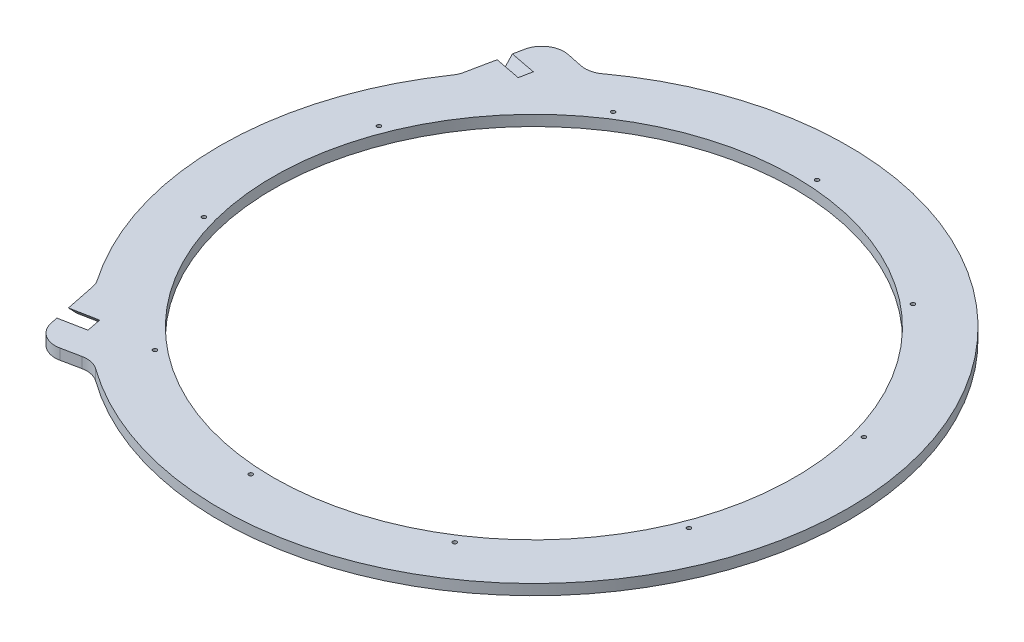
ISO-10303-21;
HEADER;
FILE_DESCRIPTION(('STEP AP214'),'2;1');
FILE_NAME('part.step','',(''),(''),'','','');
FILE_SCHEMA(('AUTOMOTIVE_DESIGN { 1 0 10303 214 1 1 1 1 }'));
ENDSEC;
DATA;
#1=APPLICATION_CONTEXT('core data for automotive mechanical design processes');
#2=APPLICATION_PROTOCOL_DEFINITION('international standard','automotive_design',2000,#1);
#3=PRODUCT_CONTEXT('',#1,'mechanical');
#4=PRODUCT('Part','Part','',(#3));
#5=PRODUCT_RELATED_PRODUCT_CATEGORY('part','',(#4));
#6=PRODUCT_DEFINITION_FORMATION('','',#4);
#7=PRODUCT_DEFINITION_CONTEXT('part definition',#1,'design');
#8=PRODUCT_DEFINITION('design','',#6,#7);
#9=PRODUCT_DEFINITION_SHAPE('','',#8);
#10=(LENGTH_UNIT() NAMED_UNIT(*) SI_UNIT(.MILLI.,.METRE.));
#11=(NAMED_UNIT(*) PLANE_ANGLE_UNIT() SI_UNIT($,.RADIAN.));
#12=(NAMED_UNIT(*) SI_UNIT($,.STERADIAN.) SOLID_ANGLE_UNIT());
#13=UNCERTAINTY_MEASURE_WITH_UNIT(LENGTH_MEASURE(1.E-05),#10,'distance_accuracy_value','');
#14=(GEOMETRIC_REPRESENTATION_CONTEXT(3) GLOBAL_UNCERTAINTY_ASSIGNED_CONTEXT((#13)) GLOBAL_UNIT_ASSIGNED_CONTEXT((#10,
#11,#12)) REPRESENTATION_CONTEXT('',''));
#15=CARTESIAN_POINT('',(0.,0.,0.));
#16=DIRECTION('',(0.,0.,1.));
#17=DIRECTION('',(1.,0.,0.));
#18=AXIS2_PLACEMENT_3D('',#15,#16,#17);
#19=CARTESIAN_POINT('',(-281.950699467775,0.,-245.84051269837));
#20=DIRECTION('',(0.979540105481507,0.,0.201249054043189));
#21=DIRECTION('',(0.201249054043189,0.,-0.979540105481507));
#22=AXIS2_PLACEMENT_3D('',#19,#20,#21);
#23=PLANE('',#22);
#24=DIRECTION('',(-0.114648249727768,-0.821864221756313,0.558027759014951));
#25=VECTOR('',#24,1.);
#26=CARTESIAN_POINT('',(-295.731190970236,-80.1248043204438,-178.766686368682));
#27=LINE('',#26,#25);
#28=CARTESIAN_POINT('',(-282.879983566072,12.,-241.317405506656));
#29=VERTEX_POINT('',#28);
#30=CARTESIAN_POINT('',(-284.553957149924,0.,-233.169669018176));
#31=VERTEX_POINT('',#30);
#32=EDGE_CURVE('E183',#29,#31,#27,.T.);
#33=ORIENTED_EDGE('',*,*,#32,.T.);
#34=DIRECTION('',(0.201249054043189,0.,-0.979540105481507));
#35=VECTOR('',#34,1.);
#36=CARTESIAN_POINT('',(-281.950699467775,0.,-245.84051269837));
#37=LINE('',#36,#35);
#38=CARTESIAN_POINT('',(-289.47071954455,0.,-209.238297128964));
#39=VERTEX_POINT('',#38);
#40=EDGE_CURVE('E212',#39,#31,#37,.T.);
#41=ORIENTED_EDGE('',*,*,#40,.F.);
#42=DIRECTION('',(0.,-1.,0.));
#43=VECTOR('',#42,1.);
#44=CARTESIAN_POINT('',(-289.47071954455,10.,-209.238297128964));
#45=LINE('',#44,#43);
#46=CARTESIAN_POINT('',(-289.47071954455,12.,-209.238297128964));
#47=VERTEX_POINT('',#46);
#48=EDGE_CURVE('E236',#39,#47,#45,.F.);
#49=ORIENTED_EDGE('',*,*,#48,.T.);
#50=DIRECTION('',(-0.201249054043192,0.,0.979540105481506));
#51=VECTOR('',#50,1.);
#52=CARTESIAN_POINT('',(-281.950699467774,12.,-245.840512698371));
#53=LINE('',#52,#51);
#54=EDGE_CURVE('E276',#29,#47,#53,.T.);
#55=ORIENTED_EDGE('',*,*,#54,.F.);
#56=EDGE_LOOP('',(#33,#41,#49,#55));
#57=FACE_BOUND('',#56,.T.);
#58=ADVANCED_FACE('F37',(#57),#23,.F.);
#59=CARTESIAN_POINT('',(-279.584698805436,0.,257.356554596679));
#60=DIRECTION('',(-0.979540105481507,0.,0.201249054043189));
#61=DIRECTION('',(0.201249054043189,0.,0.979540105481507));
#62=AXIS2_PLACEMENT_3D('',#59,#60,#61);
#63=PLANE('',#62);
#64=DIRECTION('',(0.201249054043189,0.,0.979540105481507));
#65=VECTOR('',#64,1.);
#66=CARTESIAN_POINT('',(-279.584698805436,0.,257.356554596679));
#67=LINE('',#66,#65);
#68=CARTESIAN_POINT('',(-289.47071954455,0.,209.238297128964));
#69=VERTEX_POINT('',#68);
#70=CARTESIAN_POINT('',(-284.553957149926,0.,233.169669018168));
#71=VERTEX_POINT('',#70);
#72=EDGE_CURVE('E246',#69,#71,#67,.T.);
#73=ORIENTED_EDGE('',*,*,#72,.T.);
#74=DIRECTION('',(0.140727943189144,0.714855141364583,0.684965526775162));
#75=VECTOR('',#74,1.);
#76=CARTESIAN_POINT('',(-285.869652164469,-6.68333043388236,226.765782851079));
#77=LINE('',#76,#75);
#78=CARTESIAN_POINT('',(-282.191610961793,12.,244.667923483557));
#79=VERTEX_POINT('',#78);
#80=EDGE_CURVE('E303',#71,#79,#77,.T.);
#81=ORIENTED_EDGE('',*,*,#80,.T.);
#82=DIRECTION('',(0.201249054043189,0.,0.979540105481507));
#83=VECTOR('',#82,1.);
#84=CARTESIAN_POINT('',(-289.47071954455,12.,209.238297128964));
#85=LINE('',#84,#83);
#86=CARTESIAN_POINT('',(-289.47071954455,12.,209.238297128964));
#87=VERTEX_POINT('',#86);
#88=EDGE_CURVE('E261',#87,#79,#85,.T.);
#89=ORIENTED_EDGE('',*,*,#88,.F.);
#90=DIRECTION('',(0.,1.,0.));
#91=VECTOR('',#90,1.);
#92=CARTESIAN_POINT('',(-289.47071954455,0.,209.238297128964));
#93=LINE('',#92,#91);
#94=EDGE_CURVE('E224',#87,#69,#93,.F.);
#95=ORIENTED_EDGE('',*,*,#94,.T.);
#96=EDGE_LOOP('',(#73,#81,#89,#95));
#97=FACE_BOUND('',#96,.T.);
#98=ADVANCED_FACE('F418',(#97),#63,.T.);
#99=CARTESIAN_POINT('',(0.,0.,0.));
#100=DIRECTION('',(0.,1.,0.));
#101=DIRECTION('',(0.,0.,1.));
#102=AXIS2_PLACEMENT_3D('',#99,#100,#101);
#103=PLANE('',#102);
#104=CARTESIAN_POINT('',(15.9624666541084,0.,-304.58200810016));
#105=DIRECTION('',(0.,1.,0.));
#106=DIRECTION('',(0.,0.,1.));
#107=AXIS2_PLACEMENT_3D('',#104,#105,#106);
#108=CIRCLE('',#107,2.25000000000001);
#109=CARTESIAN_POINT('',(15.9624666541084,0.,-302.33200810016));
#110=VERTEX_POINT('',#109);
#111=EDGE_CURVE('E355',#110,#110,#108,.T.);
#112=ORIENTED_EDGE('',*,*,#111,.T.);
#113=EDGE_LOOP('',(#112));
#114=FACE_BOUND('',#113,.T.);
#115=CARTESIAN_POINT('',(-166.114905679571,0.,-255.79452322337));
#116=DIRECTION('',(0.,1.,0.));
#117=DIRECTION('',(0.,0.,1.));
#118=AXIS2_PLACEMENT_3D('',#115,#116,#117);
#119=CIRCLE('',#118,2.25);
#120=CARTESIAN_POINT('',(-166.114905679571,0.,-253.54452322337));
#121=VERTEX_POINT('',#120);
#122=EDGE_CURVE('E352',#121,#121,#119,.T.);
#123=ORIENTED_EDGE('',*,*,#122,.T.);
#124=EDGE_LOOP('',(#123));
#125=FACE_BOUND('',#124,.T.);
#126=CARTESIAN_POINT('',(-284.742030081636,0.,-109.302224611331));
#127=DIRECTION('',(0.,1.,0.));
#128=DIRECTION('',(0.,0.,1.));
#129=AXIS2_PLACEMENT_3D('',#126,#127,#128);
#130=CIRCLE('',#129,2.25000000000003);
#131=CARTESIAN_POINT('',(-284.742030081636,0.,-107.05222461133));
#132=VERTEX_POINT('',#131);
#133=EDGE_CURVE('E348',#132,#132,#130,.T.);
#134=ORIENTED_EDGE('',*,*,#133,.T.);
#135=EDGE_LOOP('',(#134));
#136=FACE_BOUND('',#135,.T.);
#137=CARTESIAN_POINT('',(-294.607377018155,0.,78.9398087562552));
#138=DIRECTION('',(0.,1.,0.));
#139=DIRECTION('',(0.,0.,1.));
#140=AXIS2_PLACEMENT_3D('',#137,#138,#139);
#141=CIRCLE('',#140,2.25000000000003);
#142=CARTESIAN_POINT('',(-294.607377018155,0.,81.1898087562552));
#143=VERTEX_POINT('',#142);
#144=EDGE_CURVE('E344',#143,#143,#141,.T.);
#145=ORIENTED_EDGE('',*,*,#144,.T.);
#146=EDGE_LOOP('',(#145));
#147=FACE_BOUND('',#146,.T.);
#148=CARTESIAN_POINT('',(-191.942719270189,0.,237.029518244362));
#149=DIRECTION('',(0.,1.,0.));
#150=DIRECTION('',(0.,0.,1.));
#151=AXIS2_PLACEMENT_3D('',#148,#149,#150);
#152=CIRCLE('',#151,2.25);
#153=CARTESIAN_POINT('',(-191.942719270189,0.,239.279518244362));
#154=VERTEX_POINT('',#153);
#155=EDGE_CURVE('E340',#154,#154,#152,.T.);
#156=ORIENTED_EDGE('',*,*,#155,.T.);
#157=EDGE_LOOP('',(#156));
#158=FACE_BOUND('',#157,.T.);
#159=CARTESIAN_POINT('',(-15.9624666540851,0.,304.58200810013));
#160=DIRECTION('',(0.,1.,0.));
#161=DIRECTION('',(0.,0.,1.));
#162=AXIS2_PLACEMENT_3D('',#159,#160,#161);
#163=CIRCLE('',#162,2.25000000000001);
#164=CARTESIAN_POINT('',(-15.9624666540851,0.,306.83200810013));
#165=VERTEX_POINT('',#164);
#166=EDGE_CURVE('E336',#165,#165,#163,.T.);
#167=ORIENTED_EDGE('',*,*,#166,.T.);
#168=EDGE_LOOP('',(#167));
#169=FACE_BOUND('',#168,.T.);
#170=CARTESIAN_POINT('',(166.114905679592,0.,255.794523223341));
#171=DIRECTION('',(0.,1.,0.));
#172=DIRECTION('',(0.,0.,1.));
#173=AXIS2_PLACEMENT_3D('',#170,#171,#172);
#174=CIRCLE('',#173,2.25);
#175=CARTESIAN_POINT('',(166.114905679592,0.,258.044523223341));
#176=VERTEX_POINT('',#175);
#177=EDGE_CURVE('E332',#176,#176,#174,.T.);
#178=ORIENTED_EDGE('',*,*,#177,.T.);
#179=EDGE_LOOP('',(#178));
#180=FACE_BOUND('',#179,.T.);
#181=CARTESIAN_POINT('',(284.742030081657,0.,109.302224611303));
#182=DIRECTION('',(0.,1.,0.));
#183=DIRECTION('',(0.,0.,1.));
#184=AXIS2_PLACEMENT_3D('',#181,#182,#183);
#185=CIRCLE('',#184,2.25000000000003);
#186=CARTESIAN_POINT('',(284.742030081657,0.,111.552224611303));
#187=VERTEX_POINT('',#186);
#188=EDGE_CURVE('E328',#187,#187,#185,.T.);
#189=ORIENTED_EDGE('',*,*,#188,.T.);
#190=EDGE_LOOP('',(#189));
#191=FACE_BOUND('',#190,.T.);
#192=CARTESIAN_POINT('',(294.607377018177,0.,-78.9398087562829));
#193=DIRECTION('',(0.,1.,0.));
#194=DIRECTION('',(0.,0.,1.));
#195=AXIS2_PLACEMENT_3D('',#192,#193,#194);
#196=CIRCLE('',#195,2.25000000000003);
#197=CARTESIAN_POINT('',(294.607377018177,0.,-76.6898087562828));
#198=VERTEX_POINT('',#197);
#199=EDGE_CURVE('E324',#198,#198,#196,.T.);
#200=ORIENTED_EDGE('',*,*,#199,.T.);
#201=EDGE_LOOP('',(#200));
#202=FACE_BOUND('',#201,.T.);
#203=CARTESIAN_POINT('',(191.942719270211,0.,-237.029518244391));
#204=DIRECTION('',(0.,1.,0.));
#205=DIRECTION('',(0.,0.,1.));
#206=AXIS2_PLACEMENT_3D('',#203,#204,#205);
#207=CIRCLE('',#206,2.25);
#208=CARTESIAN_POINT('',(191.942719270211,0.,-234.779518244391));
#209=VERTEX_POINT('',#208);
#210=EDGE_CURVE('E320',#209,#209,#207,.T.);
#211=ORIENTED_EDGE('',*,*,#210,.T.);
#212=EDGE_LOOP('',(#211));
#213=FACE_BOUND('',#212,.T.);
#214=DIRECTION('',(0.979540105481507,0.,-0.201249054043189));
#215=VECTOR('',#214,1.);
#216=CARTESIAN_POINT('',(-272.100449552558,0.,293.784662730997));
#217=LINE('',#216,#215);
#218=CARTESIAN_POINT('',(-247.61194691552,0.,288.753436379918));
#219=VERTEX_POINT('',#218);
#220=CARTESIAN_POINT('',(-227.043239676894,0.,284.527542155168));
#221=VERTEX_POINT('',#220);
#222=EDGE_CURVE('E280',#219,#221,#217,.T.);
#223=ORIENTED_EDGE('',*,*,#222,.F.);
#224=CARTESIAN_POINT('',(-252.6431732666,0.,264.26493374288));
#225=DIRECTION('',(0.,1.,0.));
#226=DIRECTION('',(0.,0.,1.));
#227=AXIS2_PLACEMENT_3D('',#224,#225,#226);
#228=CIRCLE('',#227,25.);
#229=CARTESIAN_POINT('',(-277.131675903637,0.,269.29616009396));
#230=VERTEX_POINT('',#229);
#231=EDGE_CURVE('E845',#219,#230,#228,.F.);
#232=ORIENTED_EDGE('',*,*,#231,.T.);
#233=CARTESIAN_POINT('',(-281.175568359105,0.,249.613310595775));
#234=VERTEX_POINT('',#233);
#235=EDGE_CURVE('E228',#234,#230,#67,.T.);
#236=ORIENTED_EDGE('',*,*,#235,.F.);
#237=DIRECTION('',(0.981627183447666,0.,-0.190808995376537));
#238=VECTOR('',#237,1.);
#239=CARTESIAN_POINT('',(36.5163354378232,0.,187.86026012518));
#240=LINE('',#239,#238);
#241=CARTESIAN_POINT('',(-251.610471995857,0.,243.866438025));
#242=VERTEX_POINT('',#241);
#243=EDGE_CURVE('E293',#234,#242,#240,.T.);
#244=ORIENTED_EDGE('',*,*,#243,.T.);
#245=DIRECTION('',(0.190808995376539,0.,0.981627183447665));
#246=VECTOR('',#245,1.);
#247=CARTESIAN_POINT('',(-288.12680743368,0.,56.0061778998208));
#248=LINE('',#247,#246);
#249=CARTESIAN_POINT('',(-254.813420897988,0.,227.388694387595));
#250=VERTEX_POINT('',#249);
#251=EDGE_CURVE('E290',#250,#242,#248,.T.);
#252=ORIENTED_EDGE('',*,*,#251,.F.);
#253=DIRECTION('',(0.981627183447666,0.,-0.190808995376537));
#254=VECTOR('',#253,1.);
#255=CARTESIAN_POINT('',(33.3133865356923,0.,171.382516487774));
#256=LINE('',#255,#254);
#257=EDGE_CURVE('E298',#71,#250,#256,.T.);
#258=ORIENTED_EDGE('',*,*,#257,.F.);
#259=ORIENTED_EDGE('',*,*,#72,.F.);
#260=CARTESIAN_POINT('',(-309.061521654181,0.,213.263278209828));
#261=DIRECTION('',(0.,-1.,0.));
#262=DIRECTION('',(0.,0.,-1.));
#263=AXIS2_PLACEMENT_3D('',#260,#261,#262);
#264=CIRCLE('',#263,20.);
#265=CARTESIAN_POINT('',(-292.600188942906,0.,201.904381900383));
#266=VERTEX_POINT('',#265);
#267=EDGE_CURVE('E225',#69,#266,#264,.F.);
#268=ORIENTED_EDGE('',*,*,#267,.T.);
#269=CARTESIAN_POINT('',(0.,0.,0.));
#270=DIRECTION('',(0.,-1.,0.));
#271=DIRECTION('',(0.,0.,-1.));
#272=AXIS2_PLACEMENT_3D('',#269,#270,#271);
#273=CIRCLE('',#272,355.5);
#274=CARTESIAN_POINT('',(-292.600188942906,0.,-201.904381900383));
#275=VERTEX_POINT('',#274);
#276=EDGE_CURVE('E230',#275,#266,#273,.F.);
#277=ORIENTED_EDGE('',*,*,#276,.F.);
#278=CARTESIAN_POINT('',(-309.061521654181,0.,-213.263278209828));
#279=DIRECTION('',(0.,-1.,0.));
#280=DIRECTION('',(0.,0.,-1.));
#281=AXIS2_PLACEMENT_3D('',#278,#279,#280);
#282=CIRCLE('',#281,20.);
#283=EDGE_CURVE('E233',#275,#39,#282,.F.);
#284=ORIENTED_EDGE('',*,*,#283,.T.);
#285=ORIENTED_EDGE('',*,*,#40,.T.);
#286=DIRECTION('',(-0.981627183447664,0.,-0.190808995376545));
#287=VECTOR('',#286,1.);
#288=CARTESIAN_POINT('',(33.313386535695,0.,-171.38251648778));
#289=LINE('',#288,#287);
#290=CARTESIAN_POINT('',(-255.104599983765,0.,-227.445293868311));
#291=VERTEX_POINT('',#290);
#292=EDGE_CURVE('E315',#291,#31,#289,.T.);
#293=ORIENTED_EDGE('',*,*,#292,.F.);
#294=DIRECTION('',(-0.194199486667141,0.,0.980962058072696));
#295=VECTOR('',#294,1.);
#296=CARTESIAN_POINT('',(-288.812585801252,0.,-57.1757647954377));
#297=LINE('',#296,#295);
#298=CARTESIAN_POINT('',(-252.269137841639,0.,-241.768095778157));
#299=VERTEX_POINT('',#298);
#300=EDGE_CURVE('E195',#299,#291,#297,.T.);
#301=ORIENTED_EDGE('',*,*,#300,.F.);
#302=DIRECTION('',(-0.981627183447664,0.,-0.190808995376545));
#303=VECTOR('',#302,1.);
#304=CARTESIAN_POINT('',(36.0993282633597,0.,-185.714944191097));
#305=LINE('',#304,#303);
#306=CARTESIAN_POINT('',(-281.615416888366,0.,-247.472434571301));
#307=VERTEX_POINT('',#306);
#308=EDGE_CURVE('E309',#299,#307,#305,.T.);
#309=ORIENTED_EDGE('',*,*,#308,.T.);
#310=CARTESIAN_POINT('',(-277.56268473691,0.,-267.198309547458));
#311=VERTEX_POINT('',#310);
#312=EDGE_CURVE('E209',#307,#311,#37,.T.);
#313=ORIENTED_EDGE('',*,*,#312,.T.);
#314=CARTESIAN_POINT('',(-253.074182099873,0.,-262.167083196378));
#315=DIRECTION('',(0.,1.,0.));
#316=DIRECTION('',(0.,0.,1.));
#317=AXIS2_PLACEMENT_3D('',#314,#315,#316);
#318=CIRCLE('',#317,25.);
#319=CARTESIAN_POINT('',(-248.042955748792,0.,-286.655585833416));
#320=VERTEX_POINT('',#319);
#321=EDGE_CURVE('E54',#311,#320,#318,.F.);
#322=ORIENTED_EDGE('',*,*,#321,.T.);
#323=DIRECTION('',(-0.9795401054815,0.,-0.201249054043223));
#324=VECTOR('',#323,1.);
#325=CARTESIAN_POINT('',(-272.531458385829,0.,-291.686812184496));
#326=LINE('',#325,#324);
#327=CARTESIAN_POINT('',(-229.394963828579,0.,-282.82430755012));
#328=VERTEX_POINT('',#327);
#329=EDGE_CURVE('E284',#328,#320,#326,.T.);
#330=ORIENTED_EDGE('',*,*,#329,.F.);
#331=CARTESIAN_POINT('',(-224.363737477499,0.,-307.312810187158));
#332=DIRECTION('',(0.,1.,0.));
#333=DIRECTION('',(0.,0.,1.));
#334=AXIS2_PLACEMENT_3D('',#331,#332,#333);
#335=CIRCLE('',#334,25.);
#336=CARTESIAN_POINT('',(-209.622361821947,0.,-287.121429754361));
#337=VERTEX_POINT('',#336);
#338=EDGE_CURVE('E46',#328,#337,#335,.T.);
#339=ORIENTED_EDGE('',*,*,#338,.T.);
#340=CARTESIAN_POINT('',(0.,0.,0.));
#341=DIRECTION('',(0.,-1.,0.));
#342=DIRECTION('',(0.,0.,-1.));
#343=AXIS2_PLACEMENT_3D('',#340,#341,#342);
#344=CIRCLE('',#343,355.5);
#345=CARTESIAN_POINT('',(-207.425153054736,0.,288.712756698106));
#346=VERTEX_POINT('',#345);
#347=EDGE_CURVE('E219',#346,#337,#344,.F.);
#348=ORIENTED_EDGE('',*,*,#347,.F.);
#349=CARTESIAN_POINT('',(-222.012013325814,0.,309.016044792206));
#350=DIRECTION('',(0.,1.,0.));
#351=DIRECTION('',(0.,0.,1.));
#352=AXIS2_PLACEMENT_3D('',#349,#350,#351);
#353=CIRCLE('',#352,25.);
#354=EDGE_CURVE('E867',#346,#221,#353,.T.);
#355=ORIENTED_EDGE('',*,*,#354,.T.);
#356=EDGE_LOOP('',(#223,#232,#236,#244,#252,#258,#259,#268,#277,#284,#285,#293,#301,#309,#313,
#322,#330,#339,#348,#355));
#357=FACE_BOUND('',#356,.T.);
#358=CARTESIAN_POINT('',(0.,0.,0.));
#359=DIRECTION('',(0.,-1.,0.));
#360=DIRECTION('',(0.,0.,-1.));
#361=AXIS2_PLACEMENT_3D('',#358,#359,#360);
#362=CIRCLE('',#361,295.);
#363=CARTESIAN_POINT('',(0.,0.,-295.));
#364=VERTEX_POINT('',#363);
#365=EDGE_CURVE('E213',#364,#364,#362,.F.);
#366=ORIENTED_EDGE('',*,*,#365,.T.);
#367=EDGE_LOOP('',(#366));
#368=FACE_BOUND('',#367,.T.);
#369=ADVANCED_FACE('F370',(#114,#125,#136,#147,#158,#169,#180,#191,#202,#213,#357,#368),#103,.F.);
#370=CARTESIAN_POINT('',(0.,10.,0.));
#371=DIRECTION('',(0.,-1.,0.));
#372=DIRECTION('',(0.,0.,-1.));
#373=AXIS2_PLACEMENT_3D('',#370,#371,#372);
#374=CYLINDRICAL_SURFACE('',#373,295.);
#375=ORIENTED_EDGE('',*,*,#365,.F.);
#376=EDGE_LOOP('',(#375));
#377=FACE_BOUND('',#376,.T.);
#378=CARTESIAN_POINT('',(0.,12.,0.));
#379=DIRECTION('',(0.,1.,0.));
#380=DIRECTION('',(0.,0.,1.));
#381=AXIS2_PLACEMENT_3D('',#378,#379,#380);
#382=CIRCLE('',#381,295.);
#383=CARTESIAN_POINT('',(0.,12.,295.));
#384=VERTEX_POINT('',#383);
#385=EDGE_CURVE('E277',#384,#384,#382,.T.);
#386=ORIENTED_EDGE('',*,*,#385,.T.);
#387=EDGE_LOOP('',(#386));
#388=FACE_BOUND('',#387,.T.);
#389=ADVANCED_FACE('F417',(#377,#388),#374,.F.);
#390=CARTESIAN_POINT('',(-277.56268473691,12.,-267.198309547458));
#391=VERTEX_POINT('',#390);
#392=CARTESIAN_POINT('',(-279.941443304514,12.,-255.620171059781));
#393=VERTEX_POINT('',#392);
#394=EDGE_CURVE('E274',#391,#393,#53,.T.);
#395=ORIENTED_EDGE('',*,*,#394,.F.);
#396=DIRECTION('',(0.,1.,0.));
#397=VECTOR('',#396,1.);
#398=CARTESIAN_POINT('',(-277.56268473691,0.,-267.198309547458));
#399=LINE('',#398,#397);
#400=EDGE_CURVE('E863',#391,#311,#399,.F.);
#401=ORIENTED_EDGE('',*,*,#400,.T.);
#402=ORIENTED_EDGE('',*,*,#312,.F.);
#403=DIRECTION('',(0.11464824972776,0.821864221756313,-0.558027759014953));
#404=VECTOR('',#403,1.);
#405=CARTESIAN_POINT('',(-281.724229228796,-0.780029086330083,-246.942811950571));
#406=LINE('',#405,#404);
#407=EDGE_CURVE('E312',#307,#393,#406,.T.);
#408=ORIENTED_EDGE('',*,*,#407,.T.);
#409=EDGE_LOOP('',(#395,#401,#402,#408));
#410=FACE_BOUND('',#409,.T.);
#411=ADVANCED_FACE('F442',(#410),#23,.F.);
#412=CARTESIAN_POINT('',(-309.061521654181,10.,-213.263278209828));
#413=DIRECTION('',(0.,-1.,0.));
#414=DIRECTION('',(0.,0.,-1.));
#415=AXIS2_PLACEMENT_3D('',#412,#413,#414);
#416=CYLINDRICAL_SURFACE('',#415,20.);
#417=DIRECTION('',(0.,-1.,0.));
#418=VECTOR('',#417,1.);
#419=CARTESIAN_POINT('',(-292.600188942906,10.,-201.904381900383));
#420=LINE('',#419,#418);
#421=CARTESIAN_POINT('',(-292.600188942906,12.,-201.904381900383));
#422=VERTEX_POINT('',#421);
#423=EDGE_CURVE('E232',#422,#275,#420,.T.);
#424=ORIENTED_EDGE('',*,*,#423,.F.);
#425=CARTESIAN_POINT('',(-309.061521654181,12.,-213.263278209828));
#426=DIRECTION('',(0.,-1.,0.));
#427=DIRECTION('',(0.,0.,1.));
#428=AXIS2_PLACEMENT_3D('',#425,#426,#427);
#429=CIRCLE('',#428,19.9999999999999);
#430=EDGE_CURVE('E271',#47,#422,#429,.T.);
#431=ORIENTED_EDGE('',*,*,#430,.F.);
#432=ORIENTED_EDGE('',*,*,#48,.F.);
#433=ORIENTED_EDGE('',*,*,#283,.F.);
#434=EDGE_LOOP('',(#424,#431,#432,#433));
#435=FACE_BOUND('',#434,.T.);
#436=ADVANCED_FACE('F449',(#435),#416,.F.);
#437=CARTESIAN_POINT('',(0.,10.,0.));
#438=DIRECTION('',(0.,-1.,0.));
#439=DIRECTION('',(0.,0.,-1.));
#440=AXIS2_PLACEMENT_3D('',#437,#438,#439);
#441=CYLINDRICAL_SURFACE('',#440,355.5);
#442=ORIENTED_EDGE('',*,*,#276,.T.);
#443=DIRECTION('',(0.,-1.,0.));
#444=VECTOR('',#443,1.);
#445=CARTESIAN_POINT('',(-292.600188942906,10.,201.904381900383));
#446=LINE('',#445,#444);
#447=CARTESIAN_POINT('',(-292.600188942906,12.,201.904381900383));
#448=VERTEX_POINT('',#447);
#449=EDGE_CURVE('E229',#266,#448,#446,.F.);
#450=ORIENTED_EDGE('',*,*,#449,.T.);
#451=CARTESIAN_POINT('',(0.,12.,0.));
#452=DIRECTION('',(0.,1.,0.));
#453=DIRECTION('',(0.,0.,1.));
#454=AXIS2_PLACEMENT_3D('',#451,#452,#453);
#455=CIRCLE('',#454,355.5);
#456=EDGE_CURVE('E268',#422,#448,#455,.T.);
#457=ORIENTED_EDGE('',*,*,#456,.F.);
#458=ORIENTED_EDGE('',*,*,#423,.T.);
#459=EDGE_LOOP('',(#442,#450,#457,#458));
#460=FACE_BOUND('',#459,.T.);
#461=ADVANCED_FACE('F463',(#460),#441,.T.);
#462=CARTESIAN_POINT('',(-309.061521654181,10.,213.263278209828));
#463=DIRECTION('',(0.,-1.,0.));
#464=DIRECTION('',(0.,0.,-1.));
#465=AXIS2_PLACEMENT_3D('',#462,#463,#464);
#466=CYLINDRICAL_SURFACE('',#465,20.);
#467=ORIENTED_EDGE('',*,*,#94,.F.);
#468=CARTESIAN_POINT('',(-309.061521654181,12.,213.263278209828));
#469=DIRECTION('',(0.,-1.,0.));
#470=DIRECTION('',(0.,0.,1.));
#471=AXIS2_PLACEMENT_3D('',#468,#469,#470);
#472=CIRCLE('',#471,20.);
#473=EDGE_CURVE('E265',#448,#87,#472,.T.);
#474=ORIENTED_EDGE('',*,*,#473,.F.);
#475=ORIENTED_EDGE('',*,*,#449,.F.);
#476=ORIENTED_EDGE('',*,*,#267,.F.);
#477=EDGE_LOOP('',(#467,#474,#475,#476));
#478=FACE_BOUND('',#477,.T.);
#479=ADVANCED_FACE('F467',(#478),#466,.F.);
#480=ORIENTED_EDGE('',*,*,#235,.T.);
#481=DIRECTION('',(0.,1.,0.));
#482=VECTOR('',#481,1.);
#483=CARTESIAN_POINT('',(-277.131675903637,0.,269.29616009396));
#484=LINE('',#483,#482);
#485=CARTESIAN_POINT('',(-277.131675903637,12.,269.29616009396));
#486=VERTEX_POINT('',#485);
#487=EDGE_CURVE('E843',#230,#486,#484,.T.);
#488=ORIENTED_EDGE('',*,*,#487,.T.);
#489=CARTESIAN_POINT('',(-278.813222170972,12.,261.111565061164));
#490=VERTEX_POINT('',#489);
#491=EDGE_CURVE('E264',#490,#486,#85,.T.);
#492=ORIENTED_EDGE('',*,*,#491,.F.);
#493=DIRECTION('',(0.14072794318915,0.714855141364584,0.68496552677516));
#494=VECTOR('',#493,1.);
#495=CARTESIAN_POINT('',(-280.397661581188,3.95152978928164,253.399618516169));
#496=LINE('',#495,#494);
#497=EDGE_CURVE('E296',#234,#490,#496,.T.);
#498=ORIENTED_EDGE('',*,*,#497,.F.);
#499=EDGE_LOOP('',(#480,#488,#492,#498));
#500=FACE_BOUND('',#499,.T.);
#501=ADVANCED_FACE('F459',(#500),#63,.T.);
#502=CARTESIAN_POINT('',(0.,10.,0.));
#503=DIRECTION('',(0.,-1.,0.));
#504=DIRECTION('',(0.,0.,-1.));
#505=AXIS2_PLACEMENT_3D('',#502,#503,#504);
#506=CYLINDRICAL_SURFACE('',#505,355.5);
#507=CARTESIAN_POINT('',(0.,12.,0.));
#508=DIRECTION('',(0.,1.,0.));
#509=DIRECTION('',(0.,0.,1.));
#510=AXIS2_PLACEMENT_3D('',#507,#508,#509);
#511=CIRCLE('',#510,355.5);
#512=CARTESIAN_POINT('',(-207.425153054736,12.,288.712756698106));
#513=VERTEX_POINT('',#512);
#514=CARTESIAN_POINT('',(-209.622361821947,12.,-287.121429754361));
#515=VERTEX_POINT('',#514);
#516=EDGE_CURVE('E239',#513,#515,#511,.T.);
#517=ORIENTED_EDGE('',*,*,#516,.F.);
#518=DIRECTION('',(0.,-1.,0.));
#519=VECTOR('',#518,1.);
#520=CARTESIAN_POINT('',(-207.425153054736,10.,288.712756698106));
#521=LINE('',#520,#519);
#522=EDGE_CURVE('E848',#513,#346,#521,.T.);
#523=ORIENTED_EDGE('',*,*,#522,.T.);
#524=ORIENTED_EDGE('',*,*,#347,.T.);
#525=DIRECTION('',(0.,-1.,0.));
#526=VECTOR('',#525,1.);
#527=CARTESIAN_POINT('',(-209.622361821947,10.,-287.121429754361));
#528=LINE('',#527,#526);
#529=EDGE_CURVE('E851',#337,#515,#528,.F.);
#530=ORIENTED_EDGE('',*,*,#529,.T.);
#531=EDGE_LOOP('',(#517,#523,#524,#530));
#532=FACE_BOUND('',#531,.T.);
#533=ADVANCED_FACE('F368',(#532),#506,.T.);
#534=CARTESIAN_POINT('',(-259.903215352728,12.,-249.099013746168));
#535=DIRECTION('',(0.,1.,0.));
#536=DIRECTION('',(0.,0.,1.));
#537=AXIS2_PLACEMENT_3D('',#534,#535,#536);
#538=PLANE('',#537);
#539=CARTESIAN_POINT('',(15.9624666541084,12.,-304.58200810016));
#540=DIRECTION('',(0.,1.,0.));
#541=DIRECTION('',(0.,0.,1.));
#542=AXIS2_PLACEMENT_3D('',#539,#540,#541);
#543=CIRCLE('',#542,2.25);
#544=CARTESIAN_POINT('',(15.9624666541084,12.,-302.33200810016));
#545=VERTEX_POINT('',#544);
#546=EDGE_CURVE('E41',#545,#545,#543,.T.);
#547=ORIENTED_EDGE('',*,*,#546,.F.);
#548=EDGE_LOOP('',(#547));
#549=FACE_BOUND('',#548,.T.);
#550=CARTESIAN_POINT('',(-166.114905679571,12.,-255.79452322337));
#551=DIRECTION('',(0.,1.,0.));
#552=DIRECTION('',(0.,0.,1.));
#553=AXIS2_PLACEMENT_3D('',#550,#551,#552);
#554=CIRCLE('',#553,2.25);
#555=CARTESIAN_POINT('',(-166.114905679571,12.,-253.54452322337));
#556=VERTEX_POINT('',#555);
#557=EDGE_CURVE('E351',#556,#556,#554,.T.);
#558=ORIENTED_EDGE('',*,*,#557,.F.);
#559=EDGE_LOOP('',(#558));
#560=FACE_BOUND('',#559,.T.);
#561=CARTESIAN_POINT('',(-284.742030081636,12.,-109.302224611331));
#562=DIRECTION('',(0.,1.,0.));
#563=DIRECTION('',(0.,0.,1.));
#564=AXIS2_PLACEMENT_3D('',#561,#562,#563);
#565=CIRCLE('',#564,2.25);
#566=CARTESIAN_POINT('',(-284.742030081636,12.,-107.052224611331));
#567=VERTEX_POINT('',#566);
#568=EDGE_CURVE('E347',#567,#567,#565,.T.);
#569=ORIENTED_EDGE('',*,*,#568,.F.);
#570=EDGE_LOOP('',(#569));
#571=FACE_BOUND('',#570,.T.);
#572=CARTESIAN_POINT('',(-294.607377018155,12.,78.9398087562552));
#573=DIRECTION('',(0.,1.,0.));
#574=DIRECTION('',(0.,0.,1.));
#575=AXIS2_PLACEMENT_3D('',#572,#573,#574);
#576=CIRCLE('',#575,2.25);
#577=CARTESIAN_POINT('',(-294.607377018155,12.,81.1898087562552));
#578=VERTEX_POINT('',#577);
#579=EDGE_CURVE('E343',#578,#578,#576,.T.);
#580=ORIENTED_EDGE('',*,*,#579,.F.);
#581=EDGE_LOOP('',(#580));
#582=FACE_BOUND('',#581,.T.);
#583=CARTESIAN_POINT('',(-191.942719270189,12.,237.029518244362));
#584=DIRECTION('',(0.,1.,0.));
#585=DIRECTION('',(0.,0.,1.));
#586=AXIS2_PLACEMENT_3D('',#583,#584,#585);
#587=CIRCLE('',#586,2.25);
#588=CARTESIAN_POINT('',(-191.942719270189,12.,239.279518244362));
#589=VERTEX_POINT('',#588);
#590=EDGE_CURVE('E339',#589,#589,#587,.T.);
#591=ORIENTED_EDGE('',*,*,#590,.F.);
#592=EDGE_LOOP('',(#591));
#593=FACE_BOUND('',#592,.T.);
#594=CARTESIAN_POINT('',(-15.9624666540851,12.,304.58200810013));
#595=DIRECTION('',(0.,1.,0.));
#596=DIRECTION('',(0.,0.,1.));
#597=AXIS2_PLACEMENT_3D('',#594,#595,#596);
#598=CIRCLE('',#597,2.25);
#599=CARTESIAN_POINT('',(-15.9624666540851,12.,306.83200810013));
#600=VERTEX_POINT('',#599);
#601=EDGE_CURVE('E335',#600,#600,#598,.T.);
#602=ORIENTED_EDGE('',*,*,#601,.F.);
#603=EDGE_LOOP('',(#602));
#604=FACE_BOUND('',#603,.T.);
#605=CARTESIAN_POINT('',(166.114905679592,12.,255.794523223341));
#606=DIRECTION('',(0.,1.,0.));
#607=DIRECTION('',(0.,0.,1.));
#608=AXIS2_PLACEMENT_3D('',#605,#606,#607);
#609=CIRCLE('',#608,2.25);
#610=CARTESIAN_POINT('',(166.114905679592,12.,258.044523223341));
#611=VERTEX_POINT('',#610);
#612=EDGE_CURVE('E331',#611,#611,#609,.T.);
#613=ORIENTED_EDGE('',*,*,#612,.F.);
#614=EDGE_LOOP('',(#613));
#615=FACE_BOUND('',#614,.T.);
#616=CARTESIAN_POINT('',(284.742030081657,12.,109.302224611303));
#617=DIRECTION('',(0.,1.,0.));
#618=DIRECTION('',(0.,0.,1.));
#619=AXIS2_PLACEMENT_3D('',#616,#617,#618);
#620=CIRCLE('',#619,2.25);
#621=CARTESIAN_POINT('',(284.742030081657,12.,111.552224611303));
#622=VERTEX_POINT('',#621);
#623=EDGE_CURVE('E327',#622,#622,#620,.T.);
#624=ORIENTED_EDGE('',*,*,#623,.F.);
#625=EDGE_LOOP('',(#624));
#626=FACE_BOUND('',#625,.T.);
#627=CARTESIAN_POINT('',(294.607377018177,12.,-78.9398087562829));
#628=DIRECTION('',(0.,1.,0.));
#629=DIRECTION('',(0.,0.,1.));
#630=AXIS2_PLACEMENT_3D('',#627,#628,#629);
#631=CIRCLE('',#630,2.25);
#632=CARTESIAN_POINT('',(294.607377018177,12.,-76.6898087562829));
#633=VERTEX_POINT('',#632);
#634=EDGE_CURVE('E323',#633,#633,#631,.T.);
#635=ORIENTED_EDGE('',*,*,#634,.F.);
#636=EDGE_LOOP('',(#635));
#637=FACE_BOUND('',#636,.T.);
#638=CARTESIAN_POINT('',(191.942719270211,12.,-237.029518244391));
#639=DIRECTION('',(0.,1.,0.));
#640=DIRECTION('',(0.,0.,1.));
#641=AXIS2_PLACEMENT_3D('',#638,#639,#640);
#642=CIRCLE('',#641,2.25);
#643=CARTESIAN_POINT('',(191.942719270211,12.,-234.779518244391));
#644=VERTEX_POINT('',#643);
#645=EDGE_CURVE('E196',#644,#644,#642,.T.);
#646=ORIENTED_EDGE('',*,*,#645,.F.);
#647=EDGE_LOOP('',(#646));
#648=FACE_BOUND('',#647,.T.);
#649=ORIENTED_EDGE('',*,*,#491,.T.);
#650=CARTESIAN_POINT('',(-252.6431732666,12.,264.26493374288));
#651=DIRECTION('',(0.,1.,0.));
#652=DIRECTION('',(0.,0.,1.));
#653=AXIS2_PLACEMENT_3D('',#650,#651,#652);
#654=CIRCLE('',#653,25.);
#655=CARTESIAN_POINT('',(-247.61194691552,12.,288.753436379918));
#656=VERTEX_POINT('',#655);
#657=EDGE_CURVE('E846',#486,#656,#654,.T.);
#658=ORIENTED_EDGE('',*,*,#657,.T.);
#659=DIRECTION('',(0.979540105481507,0.,-0.201249054043189));
#660=VECTOR('',#659,1.);
#661=CARTESIAN_POINT('',(-272.100449552558,12.,293.784662730997));
#662=LINE('',#661,#660);
#663=CARTESIAN_POINT('',(-227.043239676894,12.,284.527542155168));
#664=VERTEX_POINT('',#663);
#665=EDGE_CURVE('E281',#656,#664,#662,.T.);
#666=ORIENTED_EDGE('',*,*,#665,.T.);
#667=CARTESIAN_POINT('',(-222.012013325814,12.,309.016044792206));
#668=DIRECTION('',(0.,1.,0.));
#669=DIRECTION('',(0.,0.,1.));
#670=AXIS2_PLACEMENT_3D('',#667,#668,#669);
#671=CIRCLE('',#670,25.);
#672=EDGE_CURVE('E865',#664,#513,#671,.F.);
#673=ORIENTED_EDGE('',*,*,#672,.T.);
#674=ORIENTED_EDGE('',*,*,#516,.T.);
#675=CARTESIAN_POINT('',(-224.363737477499,12.,-307.312810187158));
#676=DIRECTION('',(0.,1.,0.));
#677=DIRECTION('',(0.,0.,1.));
#678=AXIS2_PLACEMENT_3D('',#675,#676,#677);
#679=CIRCLE('',#678,25.);
#680=CARTESIAN_POINT('',(-229.394963828579,12.,-282.82430755012));
#681=VERTEX_POINT('',#680);
#682=EDGE_CURVE('E11',#515,#681,#679,.F.);
#683=ORIENTED_EDGE('',*,*,#682,.T.);
#684=DIRECTION('',(-0.9795401054815,0.,-0.201249054043223));
#685=VECTOR('',#684,1.);
#686=CARTESIAN_POINT('',(-272.531458385829,12.,-291.686812184496));
#687=LINE('',#686,#685);
#688=CARTESIAN_POINT('',(-248.042955748792,12.,-286.655585833416));
#689=VERTEX_POINT('',#688);
#690=EDGE_CURVE('E287',#681,#689,#687,.T.);
#691=ORIENTED_EDGE('',*,*,#690,.T.);
#692=CARTESIAN_POINT('',(-253.074182099873,12.,-262.167083196378));
#693=DIRECTION('',(0.,1.,0.));
#694=DIRECTION('',(0.,0.,1.));
#695=AXIS2_PLACEMENT_3D('',#692,#693,#694);
#696=CIRCLE('',#695,25.);
#697=EDGE_CURVE('E847',#689,#391,#696,.T.);
#698=ORIENTED_EDGE('',*,*,#697,.T.);
#699=ORIENTED_EDGE('',*,*,#394,.T.);
#700=DIRECTION('',(-0.981627183447664,0.,-0.190808995376545));
#701=VECTOR('',#700,1.);
#702=CARTESIAN_POINT('',(-259.411334349917,12.,-251.629522134555));
#703=LINE('',#702,#701);
#704=CARTESIAN_POINT('',(-250.595164257787,12.,-249.915832266636));
#705=VERTEX_POINT('',#704);
#706=EDGE_CURVE('E203',#705,#393,#703,.T.);
#707=ORIENTED_EDGE('',*,*,#706,.F.);
#708=DIRECTION('',(-0.194199486667141,0.,0.980962058072696));
#709=VECTOR('',#708,1.);
#710=CARTESIAN_POINT('',(-251.101808719859,12.,-247.356613379114));
#711=LINE('',#710,#709);
#712=CARTESIAN_POINT('',(-253.430626399913,12.,-235.59303035679));
#713=VERTEX_POINT('',#712);
#714=EDGE_CURVE('E187',#705,#713,#711,.T.);
#715=ORIENTED_EDGE('',*,*,#714,.T.);
#716=DIRECTION('',(-0.981627183447664,0.,-0.190808995376545));
#717=VECTOR('',#716,1.);
#718=CARTESIAN_POINT('',(-262.197276077582,12.,-237.297094431238));
#719=LINE('',#718,#717);
#720=EDGE_CURVE('E177',#713,#29,#719,.T.);
#721=ORIENTED_EDGE('',*,*,#720,.T.);
#722=ORIENTED_EDGE('',*,*,#54,.T.);
#723=ORIENTED_EDGE('',*,*,#430,.T.);
#724=ORIENTED_EDGE('',*,*,#456,.T.);
#725=ORIENTED_EDGE('',*,*,#473,.T.);
#726=ORIENTED_EDGE('',*,*,#88,.T.);
#727=DIRECTION('',(0.981627183447666,0.,-0.190808995376537));
#728=VECTOR('',#727,1.);
#729=CARTESIAN_POINT('',(-168.230517732285,12.,222.516130951934));
#730=LINE('',#729,#728);
#731=CARTESIAN_POINT('',(-252.573751458434,12.,238.910794797297));
#732=VERTEX_POINT('',#731);
#733=EDGE_CURVE('E223',#79,#732,#730,.T.);
#734=ORIENTED_EDGE('',*,*,#733,.T.);
#735=DIRECTION('',(0.190808995376539,0.,0.981627183447665));
#736=VECTOR('',#735,1.);
#737=CARTESIAN_POINT('',(-344.246449078878,12.,-232.704349900805));
#738=LINE('',#737,#736);
#739=CARTESIAN_POINT('',(-249.370802556303,12.,255.388538434703));
#740=VERTEX_POINT('',#739);
#741=EDGE_CURVE('E242',#732,#740,#738,.T.);
#742=ORIENTED_EDGE('',*,*,#741,.T.);
#743=DIRECTION('',(0.981627183447666,0.,-0.190808995376537));
#744=VECTOR('',#743,1.);
#745=CARTESIAN_POINT('',(-165.027568830154,12.,238.99387458934));
#746=LINE('',#745,#744);
#747=EDGE_CURVE('E188',#490,#740,#746,.T.);
#748=ORIENTED_EDGE('',*,*,#747,.F.);
#749=EDGE_LOOP('',(#649,#658,#666,#673,#674,#683,#691,#698,#699,#707,#715,#721,#722,#723,#724,
#725,#726,#734,#742,#748));
#750=FACE_BOUND('',#749,.T.);
#751=ORIENTED_EDGE('',*,*,#385,.F.);
#752=EDGE_LOOP('',(#751));
#753=FACE_BOUND('',#752,.T.);
#754=ADVANCED_FACE('F200',(#549,#560,#571,#582,#593,#604,#615,#626,#637,#648,#750,#753),#538,.T.);
#755=CARTESIAN_POINT('',(-272.100449552558,0.,293.784662730997));
#756=DIRECTION('',(0.201249054043189,0.,0.979540105481507));
#757=DIRECTION('',(0.979540105481507,0.,-0.201249054043189));
#758=AXIS2_PLACEMENT_3D('',#755,#756,#757);
#759=PLANE('',#758);
#760=ORIENTED_EDGE('',*,*,#222,.T.);
#761=DIRECTION('',(0.,1.,0.));
#762=VECTOR('',#761,1.);
#763=CARTESIAN_POINT('',(-227.043239676894,12.,284.527542155168));
#764=LINE('',#763,#762);
#765=EDGE_CURVE('E873',#221,#664,#764,.T.);
#766=ORIENTED_EDGE('',*,*,#765,.T.);
#767=ORIENTED_EDGE('',*,*,#665,.F.);
#768=DIRECTION('',(0.,1.,0.));
#769=VECTOR('',#768,1.);
#770=CARTESIAN_POINT('',(-247.61194691552,0.,288.753436379918));
#771=LINE('',#770,#769);
#772=EDGE_CURVE('E205',#656,#219,#771,.F.);
#773=ORIENTED_EDGE('',*,*,#772,.T.);
#774=EDGE_LOOP('',(#760,#766,#767,#773));
#775=FACE_BOUND('',#774,.T.);
#776=ADVANCED_FACE('F367',(#775),#759,.T.);
#777=CARTESIAN_POINT('',(-272.531458385829,0.,-291.686812184496));
#778=DIRECTION('',(0.201249054043223,0.,-0.9795401054815));
#779=DIRECTION('',(-0.9795401054815,0.,-0.201249054043223));
#780=AXIS2_PLACEMENT_3D('',#777,#778,#779);
#781=PLANE('',#780);
#782=ORIENTED_EDGE('',*,*,#690,.F.);
#783=DIRECTION('',(0.,1.,0.));
#784=VECTOR('',#783,1.);
#785=CARTESIAN_POINT('',(-229.394963828579,0.,-282.82430755012));
#786=LINE('',#785,#784);
#787=EDGE_CURVE('E861',#681,#328,#786,.F.);
#788=ORIENTED_EDGE('',*,*,#787,.T.);
#789=ORIENTED_EDGE('',*,*,#329,.T.);
#790=DIRECTION('',(0.,1.,0.));
#791=VECTOR('',#790,1.);
#792=CARTESIAN_POINT('',(-248.042955748792,12.,-286.655585833416));
#793=LINE('',#792,#791);
#794=EDGE_CURVE('E858',#320,#689,#793,.T.);
#795=ORIENTED_EDGE('',*,*,#794,.T.);
#796=EDGE_LOOP('',(#782,#788,#789,#795));
#797=FACE_BOUND('',#796,.T.);
#798=ADVANCED_FACE('F477',(#797),#781,.T.);
#799=CARTESIAN_POINT('',(-250.896198121811,3.82703194372299,247.541058552227));
#800=DIRECTION('',(-0.981627183447665,0.,0.190808995376539));
#801=DIRECTION('',(0.190808995376539,0.,0.981627183447665));
#802=AXIS2_PLACEMENT_3D('',#799,#800,#801);
#803=PLANE('',#802);
#804=ORIENTED_EDGE('',*,*,#251,.T.);
#805=DIRECTION('',(-0.133423632032483,-0.714874952577333,-0.686405081998099));
#806=VECTOR('',#805,1.);
#807=CARTESIAN_POINT('',(-250.896198121811,3.82703194372299,247.541058552227));
#808=LINE('',#807,#806);
#809=EDGE_CURVE('E300',#740,#242,#808,.T.);
#810=ORIENTED_EDGE('',*,*,#809,.F.);
#811=ORIENTED_EDGE('',*,*,#741,.F.);
#812=DIRECTION('',(0.133423632032487,0.714874952577332,0.686405081998098));
#813=VECTOR('',#812,1.);
#814=CARTESIAN_POINT('',(-252.533052980064,12.2180597421258,239.120170317637));
#815=LINE('',#814,#813);
#816=EDGE_CURVE('E301',#250,#732,#815,.T.);
#817=ORIENTED_EDGE('',*,*,#816,.F.);
#818=EDGE_LOOP('',(#804,#810,#811,#817));
#819=FACE_BOUND('',#818,.T.);
#820=ADVANCED_FACE('F481',(#819),#803,.T.);
#821=CARTESIAN_POINT('',(18.6615343839085,-95.6648373474591,96.0052716589087));
#822=DIRECTION('',(0.13640457152113,-0.699252316533564,0.701740686215771));
#823=DIRECTION('',(0.,-0.70836158952431,-0.705849742145305));
#824=AXIS2_PLACEMENT_3D('',#821,#822,#823);
#825=PLANE('',#824);
#826=ORIENTED_EDGE('',*,*,#497,.T.);
#827=ORIENTED_EDGE('',*,*,#747,.T.);
#828=ORIENTED_EDGE('',*,*,#809,.T.);
#829=ORIENTED_EDGE('',*,*,#243,.F.);
#830=EDGE_LOOP('',(#826,#827,#828,#829));
#831=FACE_BOUND('',#830,.T.);
#832=ADVANCED_FACE('F485',(#831),#825,.F.);
#833=CARTESIAN_POINT('',(17.0246795256549,-87.2738095490563,87.5843834243195));
#834=DIRECTION('',(0.13640457152113,-0.699252316533564,0.701740686215771));
#835=DIRECTION('',(0.,-0.70836158952431,-0.705849742145305));
#836=AXIS2_PLACEMENT_3D('',#833,#834,#835);
#837=PLANE('',#836);
#838=ORIENTED_EDGE('',*,*,#257,.T.);
#839=ORIENTED_EDGE('',*,*,#816,.T.);
#840=ORIENTED_EDGE('',*,*,#733,.F.);
#841=ORIENTED_EDGE('',*,*,#80,.F.);
#842=EDGE_LOOP('',(#838,#839,#840,#841));
#843=FACE_BOUND('',#842,.T.);
#844=ADVANCED_FACE('F487',(#843),#837,.T.);
#845=CARTESIAN_POINT('',(-264.42083120669,-87.1102876337236,-182.622123355223));
#846=DIRECTION('',(-0.980949870417078,0.0049847987682498,-0.194197073896489));
#847=DIRECTION('',(-0.194199486667141,0.,0.980962058072696));
#848=AXIS2_PLACEMENT_3D('',#845,#846,#847);
#849=PLANE('',#848);
#850=ORIENTED_EDGE('',*,*,#300,.T.);
#851=DIRECTION('',(-0.114648249727767,-0.821864221756313,0.558027759014952));
#852=VECTOR('',#851,1.);
#853=CARTESIAN_POINT('',(-266.302694857724,-80.2743482834916,-172.940774151787));
#854=LINE('',#853,#852);
#855=EDGE_CURVE('E180',#713,#291,#854,.T.);
#856=ORIENTED_EDGE('',*,*,#855,.F.);
#857=ORIENTED_EDGE('',*,*,#714,.F.);
#858=DIRECTION('',(-0.114648249727767,-0.821864221756313,0.558027759014952));
#859=VECTOR('',#858,1.);
#860=CARTESIAN_POINT('',(-264.42083120669,-87.1102876337236,-182.622123355223));
#861=LINE('',#860,#859);
#862=EDGE_CURVE('E317',#705,#299,#861,.T.);
#863=ORIENTED_EDGE('',*,*,#862,.T.);
#864=EDGE_LOOP('',(#850,#856,#857,#863));
#865=FACE_BOUND('',#864,.T.);
#866=ADVANCED_FACE('F191',(#865),#849,.T.);
#867=CARTESIAN_POINT('',(24.3845781162503,-88.5778823519377,-125.447779275697));
#868=DIRECTION('',(0.156821970919504,-0.569661612519336,-0.806779100286313));
#869=DIRECTION('',(0.,0.816886528992573,-0.576798403907696));
#870=AXIS2_PLACEMENT_3D('',#867,#868,#869);
#871=PLANE('',#870);
#872=ORIENTED_EDGE('',*,*,#862,.F.);
#873=ORIENTED_EDGE('',*,*,#706,.T.);
#874=ORIENTED_EDGE('',*,*,#407,.F.);
#875=ORIENTED_EDGE('',*,*,#308,.F.);
#876=EDGE_LOOP('',(#872,#873,#874,#875));
#877=FACE_BOUND('',#876,.T.);
#878=ADVANCED_FACE('F496',(#877),#871,.F.);
#879=CARTESIAN_POINT('',(22.5027144652162,-81.7419430017056,-115.766430072261));
#880=DIRECTION('',(0.156821970919504,-0.569661612519336,-0.806779100286313));
#881=DIRECTION('',(0.,0.816886528992573,-0.576798403907696));
#882=AXIS2_PLACEMENT_3D('',#879,#880,#881);
#883=PLANE('',#882);
#884=ORIENTED_EDGE('',*,*,#292,.T.);
#885=ORIENTED_EDGE('',*,*,#32,.F.);
#886=ORIENTED_EDGE('',*,*,#720,.F.);
#887=ORIENTED_EDGE('',*,*,#855,.T.);
#888=EDGE_LOOP('',(#884,#885,#886,#887));
#889=FACE_BOUND('',#888,.T.);
#890=ADVANCED_FACE('F179',(#889),#883,.T.);
#891=CARTESIAN_POINT('',(-222.012013325814,10.,309.016044792206));
#892=DIRECTION('',(0.,-1.,0.));
#893=DIRECTION('',(0.,0.,-1.));
#894=AXIS2_PLACEMENT_3D('',#891,#892,#893);
#895=CYLINDRICAL_SURFACE('',#894,25.);
#896=ORIENTED_EDGE('',*,*,#354,.F.);
#897=ORIENTED_EDGE('',*,*,#522,.F.);
#898=ORIENTED_EDGE('',*,*,#672,.F.);
#899=ORIENTED_EDGE('',*,*,#765,.F.);
#900=EDGE_LOOP('',(#896,#897,#898,#899));
#901=FACE_BOUND('',#900,.T.);
#902=ADVANCED_FACE('F499',(#901),#895,.F.);
#903=CARTESIAN_POINT('',(-252.6431732666,0.,264.26493374288));
#904=DIRECTION('',(0.,1.,0.));
#905=DIRECTION('',(0.,0.,1.));
#906=AXIS2_PLACEMENT_3D('',#903,#904,#905);
#907=CYLINDRICAL_SURFACE('',#906,25.);
#908=ORIENTED_EDGE('',*,*,#231,.F.);
#909=ORIENTED_EDGE('',*,*,#772,.F.);
#910=ORIENTED_EDGE('',*,*,#657,.F.);
#911=ORIENTED_EDGE('',*,*,#487,.F.);
#912=EDGE_LOOP('',(#908,#909,#910,#911));
#913=FACE_BOUND('',#912,.T.);
#914=ADVANCED_FACE('F585',(#913),#907,.T.);
#915=CARTESIAN_POINT('',(-224.363737477499,10.,-307.312810187158));
#916=DIRECTION('',(0.,-1.,0.));
#917=DIRECTION('',(0.,0.,-1.));
#918=AXIS2_PLACEMENT_3D('',#915,#916,#917);
#919=CYLINDRICAL_SURFACE('',#918,25.);
#920=ORIENTED_EDGE('',*,*,#682,.F.);
#921=ORIENTED_EDGE('',*,*,#529,.F.);
#922=ORIENTED_EDGE('',*,*,#338,.F.);
#923=ORIENTED_EDGE('',*,*,#787,.F.);
#924=EDGE_LOOP('',(#920,#921,#922,#923));
#925=FACE_BOUND('',#924,.T.);
#926=ADVANCED_FACE('F578',(#925),#919,.F.);
#927=CARTESIAN_POINT('',(-253.074182099873,0.,-262.167083196378));
#928=DIRECTION('',(0.,-1.,0.));
#929=DIRECTION('',(0.,0.,-1.));
#930=AXIS2_PLACEMENT_3D('',#927,#928,#929);
#931=CYLINDRICAL_SURFACE('',#930,25.);
#932=ORIENTED_EDGE('',*,*,#321,.F.);
#933=ORIENTED_EDGE('',*,*,#400,.F.);
#934=ORIENTED_EDGE('',*,*,#697,.F.);
#935=ORIENTED_EDGE('',*,*,#794,.F.);
#936=EDGE_LOOP('',(#932,#933,#934,#935));
#937=FACE_BOUND('',#936,.T.);
#938=ADVANCED_FACE('F39',(#937),#931,.T.);
#939=CARTESIAN_POINT('',(191.942719270211,24.,-237.029518244391));
#940=DIRECTION('',(0.,1.,0.));
#941=DIRECTION('',(0.,0.,1.));
#942=AXIS2_PLACEMENT_3D('',#939,#940,#941);
#943=CYLINDRICAL_SURFACE('',#942,2.25);
#944=ORIENTED_EDGE('',*,*,#645,.T.);
#945=EDGE_LOOP('',(#944));
#946=FACE_BOUND('',#945,.T.);
#947=ORIENTED_EDGE('',*,*,#210,.F.);
#948=EDGE_LOOP('',(#947));
#949=FACE_BOUND('',#948,.T.);
#950=ADVANCED_FACE('F503',(#946,#949),#943,.F.);
#951=CARTESIAN_POINT('',(294.607377018177,24.,-78.9398087562829));
#952=DIRECTION('',(0.,1.,0.));
#953=DIRECTION('',(0.,0.,1.));
#954=AXIS2_PLACEMENT_3D('',#951,#952,#953);
#955=CYLINDRICAL_SURFACE('',#954,2.25);
#956=ORIENTED_EDGE('',*,*,#634,.T.);
#957=EDGE_LOOP('',(#956));
#958=FACE_BOUND('',#957,.T.);
#959=ORIENTED_EDGE('',*,*,#199,.F.);
#960=EDGE_LOOP('',(#959));
#961=FACE_BOUND('',#960,.T.);
#962=ADVANCED_FACE('F506',(#958,#961),#955,.F.);
#963=CARTESIAN_POINT('',(284.742030081657,24.,109.302224611303));
#964=DIRECTION('',(0.,1.,0.));
#965=DIRECTION('',(0.,0.,1.));
#966=AXIS2_PLACEMENT_3D('',#963,#964,#965);
#967=CYLINDRICAL_SURFACE('',#966,2.25);
#968=ORIENTED_EDGE('',*,*,#623,.T.);
#969=EDGE_LOOP('',(#968));
#970=FACE_BOUND('',#969,.T.);
#971=ORIENTED_EDGE('',*,*,#188,.F.);
#972=EDGE_LOOP('',(#971));
#973=FACE_BOUND('',#972,.T.);
#974=ADVANCED_FACE('F509',(#970,#973),#967,.F.);
#975=CARTESIAN_POINT('',(166.114905679592,24.,255.794523223341));
#976=DIRECTION('',(0.,1.,0.));
#977=DIRECTION('',(0.,0.,1.));
#978=AXIS2_PLACEMENT_3D('',#975,#976,#977);
#979=CYLINDRICAL_SURFACE('',#978,2.25);
#980=ORIENTED_EDGE('',*,*,#612,.T.);
#981=EDGE_LOOP('',(#980));
#982=FACE_BOUND('',#981,.T.);
#983=ORIENTED_EDGE('',*,*,#177,.F.);
#984=EDGE_LOOP('',(#983));
#985=FACE_BOUND('',#984,.T.);
#986=ADVANCED_FACE('F513',(#982,#985),#979,.F.);
#987=CARTESIAN_POINT('',(-15.9624666540851,24.,304.58200810013));
#988=DIRECTION('',(0.,1.,0.));
#989=DIRECTION('',(0.,0.,1.));
#990=AXIS2_PLACEMENT_3D('',#987,#988,#989);
#991=CYLINDRICAL_SURFACE('',#990,2.25);
#992=ORIENTED_EDGE('',*,*,#601,.T.);
#993=EDGE_LOOP('',(#992));
#994=FACE_BOUND('',#993,.T.);
#995=ORIENTED_EDGE('',*,*,#166,.F.);
#996=EDGE_LOOP('',(#995));
#997=FACE_BOUND('',#996,.T.);
#998=ADVANCED_FACE('F517',(#994,#997),#991,.F.);
#999=CARTESIAN_POINT('',(-191.942719270189,24.,237.029518244362));
#1000=DIRECTION('',(0.,1.,0.));
#1001=DIRECTION('',(0.,0.,1.));
#1002=AXIS2_PLACEMENT_3D('',#999,#1000,#1001);
#1003=CYLINDRICAL_SURFACE('',#1002,2.25);
#1004=ORIENTED_EDGE('',*,*,#590,.T.);
#1005=EDGE_LOOP('',(#1004));
#1006=FACE_BOUND('',#1005,.T.);
#1007=ORIENTED_EDGE('',*,*,#155,.F.);
#1008=EDGE_LOOP('',(#1007));
#1009=FACE_BOUND('',#1008,.T.);
#1010=ADVANCED_FACE('F521',(#1006,#1009),#1003,.F.);
#1011=CARTESIAN_POINT('',(-294.607377018155,24.,78.9398087562552));
#1012=DIRECTION('',(0.,1.,0.));
#1013=DIRECTION('',(0.,0.,1.));
#1014=AXIS2_PLACEMENT_3D('',#1011,#1012,#1013);
#1015=CYLINDRICAL_SURFACE('',#1014,2.25);
#1016=ORIENTED_EDGE('',*,*,#579,.T.);
#1017=EDGE_LOOP('',(#1016));
#1018=FACE_BOUND('',#1017,.T.);
#1019=ORIENTED_EDGE('',*,*,#144,.F.);
#1020=EDGE_LOOP('',(#1019));
#1021=FACE_BOUND('',#1020,.T.);
#1022=ADVANCED_FACE('F525',(#1018,#1021),#1015,.F.);
#1023=CARTESIAN_POINT('',(-284.742030081636,24.,-109.302224611331));
#1024=DIRECTION('',(0.,1.,0.));
#1025=DIRECTION('',(0.,0.,1.));
#1026=AXIS2_PLACEMENT_3D('',#1023,#1024,#1025);
#1027=CYLINDRICAL_SURFACE('',#1026,2.25);
#1028=ORIENTED_EDGE('',*,*,#568,.T.);
#1029=EDGE_LOOP('',(#1028));
#1030=FACE_BOUND('',#1029,.T.);
#1031=ORIENTED_EDGE('',*,*,#133,.F.);
#1032=EDGE_LOOP('',(#1031));
#1033=FACE_BOUND('',#1032,.T.);
#1034=ADVANCED_FACE('F411',(#1030,#1033),#1027,.F.);
#1035=CARTESIAN_POINT('',(-166.114905679571,24.,-255.79452322337));
#1036=DIRECTION('',(0.,1.,0.));
#1037=DIRECTION('',(0.,0.,1.));
#1038=AXIS2_PLACEMENT_3D('',#1035,#1036,#1037);
#1039=CYLINDRICAL_SURFACE('',#1038,2.25);
#1040=ORIENTED_EDGE('',*,*,#557,.T.);
#1041=EDGE_LOOP('',(#1040));
#1042=FACE_BOUND('',#1041,.T.);
#1043=ORIENTED_EDGE('',*,*,#122,.F.);
#1044=EDGE_LOOP('',(#1043));
#1045=FACE_BOUND('',#1044,.T.);
#1046=ADVANCED_FACE('F408',(#1042,#1045),#1039,.F.);
#1047=CARTESIAN_POINT('',(15.9624666541084,24.,-304.58200810016));
#1048=DIRECTION('',(0.,1.,0.));
#1049=DIRECTION('',(0.,0.,1.));
#1050=AXIS2_PLACEMENT_3D('',#1047,#1048,#1049);
#1051=CYLINDRICAL_SURFACE('',#1050,2.25);
#1052=ORIENTED_EDGE('',*,*,#546,.T.);
#1053=EDGE_LOOP('',(#1052));
#1054=FACE_BOUND('',#1053,.T.);
#1055=ORIENTED_EDGE('',*,*,#111,.F.);
#1056=EDGE_LOOP('',(#1055));
#1057=FACE_BOUND('',#1056,.T.);
#1058=ADVANCED_FACE('F362',(#1054,#1057),#1051,.F.);
#1059=CLOSED_SHELL('',(#58,#98,#369,#389,#411,#436,#461,#479,#501,#533,#754,#776,#798,#820,#832,
#844,#866,#878,#890,#902,#914,#926,#938,#950,#962,#974,#986,#998,#1010,#1022,#1034,#1046,#1058));
#1060=MANIFOLD_SOLID_BREP('B2',#1059);
#1061=ADVANCED_BREP_SHAPE_REPRESENTATION('',(#18,#1060),#14);
#1062=SHAPE_DEFINITION_REPRESENTATION(#9,#1061);
ENDSEC;
END-ISO-10303-21;
